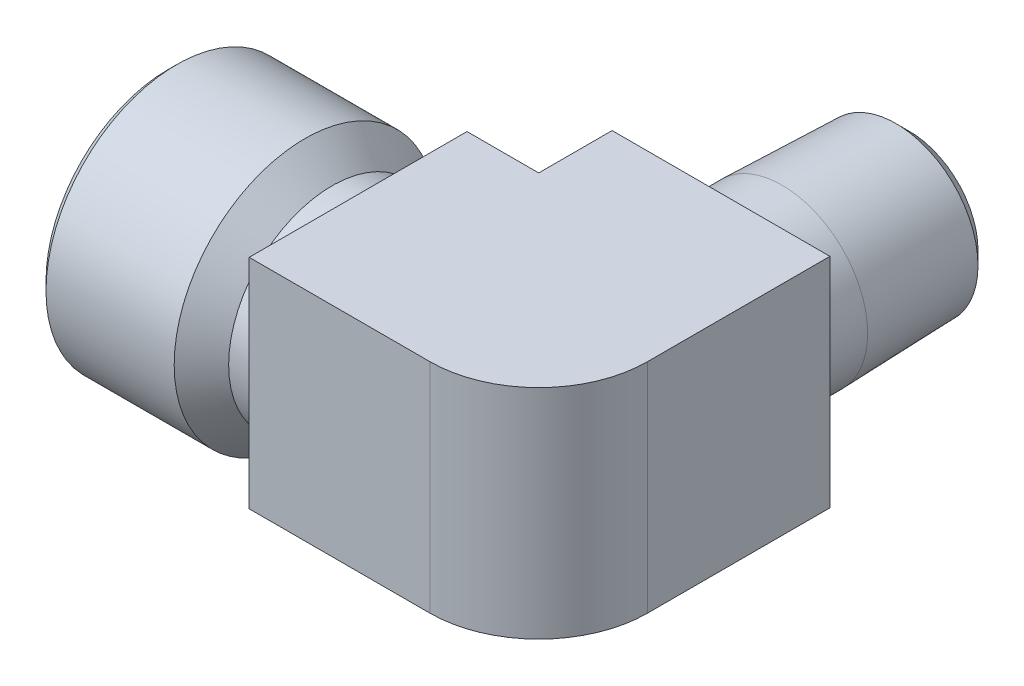
ISO-10303-21;
HEADER;
FILE_DESCRIPTION(('STEP AP214'),'2;1');
FILE_NAME('part.step','',(''),(''),'','','');
FILE_SCHEMA(('AUTOMOTIVE_DESIGN { 1 0 10303 214 1 1 1 1 }'));
ENDSEC;
DATA;
#1=APPLICATION_CONTEXT('core data for automotive mechanical design processes');
#2=APPLICATION_PROTOCOL_DEFINITION('international standard','automotive_design',2000,#1);
#3=PRODUCT_CONTEXT('',#1,'mechanical');
#4=PRODUCT('Part','Part','',(#3));
#5=PRODUCT_RELATED_PRODUCT_CATEGORY('part','',(#4));
#6=PRODUCT_DEFINITION_FORMATION('','',#4);
#7=PRODUCT_DEFINITION_CONTEXT('part definition',#1,'design');
#8=PRODUCT_DEFINITION('design','',#6,#7);
#9=PRODUCT_DEFINITION_SHAPE('','',#8);
#10=(LENGTH_UNIT() NAMED_UNIT(*) SI_UNIT(.MILLI.,.METRE.));
#11=(NAMED_UNIT(*) PLANE_ANGLE_UNIT() SI_UNIT($,.RADIAN.));
#12=(NAMED_UNIT(*) SI_UNIT($,.STERADIAN.) SOLID_ANGLE_UNIT());
#13=UNCERTAINTY_MEASURE_WITH_UNIT(LENGTH_MEASURE(1.E-05),#10,'distance_accuracy_value','');
#14=(GEOMETRIC_REPRESENTATION_CONTEXT(3) GLOBAL_UNCERTAINTY_ASSIGNED_CONTEXT((#13)) GLOBAL_UNIT_ASSIGNED_CONTEXT((#10,
#11,#12)) REPRESENTATION_CONTEXT('',''));
#15=CARTESIAN_POINT('',(0.,0.,0.));
#16=DIRECTION('',(0.,0.,1.));
#17=DIRECTION('',(1.,0.,0.));
#18=AXIS2_PLACEMENT_3D('',#15,#16,#17);
#19=CARTESIAN_POINT('',(1.12877599997319,0.,0.));
#20=DIRECTION('',(-1.,0.,0.));
#21=DIRECTION('',(0.,0.,1.));
#22=AXIS2_PLACEMENT_3D('',#19,#20,#21);
#23=CONICAL_SURFACE('',#22,5.67931299999991,0.0256563400042754);
#24=CARTESIAN_POINT('',(10.0203,0.,0.));
#25=DIRECTION('',(1.,0.,0.));
#26=DIRECTION('',(0.,0.,-1.));
#27=AXIS2_PLACEMENT_3D('',#24,#25,#26);
#28=CIRCLE('',#27,5.45113896988587);
#29=CARTESIAN_POINT('',(10.0203,0.,-5.45113896988587));
#30=VERTEX_POINT('',#29);
#31=EDGE_CURVE('E104',#30,#30,#28,.T.);
#32=ORIENTED_EDGE('',*,*,#31,.T.);
#33=EDGE_LOOP('',(#32));
#34=FACE_BOUND('',#33,.T.);
#35=CARTESIAN_POINT('',(1.12877600003003,0.,0.));
#36=DIRECTION('',(-1.,0.,0.));
#37=DIRECTION('',(0.,0.,-1.));
#38=AXIS2_PLACEMENT_3D('',#35,#36,#37);
#39=CIRCLE('',#38,5.67931299997326);
#40=CARTESIAN_POINT('',(1.12877600003003,0.,-5.67931299997326));
#41=VERTEX_POINT('',#40);
#42=EDGE_CURVE('E256',#41,#41,#39,.T.);
#43=ORIENTED_EDGE('',*,*,#42,.T.);
#44=EDGE_LOOP('',(#43));
#45=FACE_BOUND('',#44,.T.);
#46=ADVANCED_FACE('F16',(#34,#45),#23,.F.);
#47=CARTESIAN_POINT('',(-5.68438357222604E-11,0.,0.));
#48=DIRECTION('',(-1.,0.,0.));
#49=DIRECTION('',(0.,0.,1.));
#50=AXIS2_PLACEMENT_3D('',#47,#48,#49);
#51=CONICAL_SURFACE('',#50,6.80808900006014,0.785398163397448);
#52=ORIENTED_EDGE('',*,*,#42,.F.);
#53=EDGE_LOOP('',(#52));
#54=FACE_BOUND('',#53,.T.);
#55=CARTESIAN_POINT('',(5.68430019993557E-11,0.,0.));
#56=DIRECTION('',(-1.,0.,0.));
#57=DIRECTION('',(0.,0.,1.));
#58=AXIS2_PLACEMENT_3D('',#55,#56,#57);
#59=CIRCLE('',#58,6.80808899994645);
#60=CARTESIAN_POINT('',(5.68425851379033E-11,0.,6.80808899994645));
#61=VERTEX_POINT('',#60);
#62=EDGE_CURVE('E103',#61,#61,#59,.F.);
#63=ORIENTED_EDGE('',*,*,#62,.F.);
#64=EDGE_LOOP('',(#63));
#65=FACE_BOUND('',#64,.T.);
#66=ADVANCED_FACE('F148',(#54,#65),#51,.F.);
#67=CARTESIAN_POINT('',(13.9114305150571,0.,0.));
#68=DIRECTION('',(1.,0.,0.));
#69=DIRECTION('',(0.,0.,-1.));
#70=AXIS2_PLACEMENT_3D('',#67,#68,#69);
#71=CYLINDRICAL_SURFACE('',#70,5.45113896988587);
#72=CARTESIAN_POINT('',(27.8228610301141,0.,0.));
#73=DIRECTION('',(1.,0.,0.));
#74=DIRECTION('',(0.,1.,0.));
#75=AXIS2_PLACEMENT_3D('',#72,#73,#74);
#76=CIRCLE('',#75,5.45113896988587);
#77=CARTESIAN_POINT('',(27.8228610301141,3.00891746061934,-4.54547376894735));
#78=VERTEX_POINT('',#77);
#79=CARTESIAN_POINT('',(27.8228610301141,-3.00891746061934,-4.54547376894734));
#80=VERTEX_POINT('',#79);
#81=EDGE_CURVE('E97',#78,#80,#76,.T.);
#82=ORIENTED_EDGE('',*,*,#81,.T.);
#83=CARTESIAN_POINT('',(27.8228610301141,-3.00891746061933,-4.54547376894736));
#84=CARTESIAN_POINT('',(27.7349198119855,-2.95351373307247,-4.58215871475006));
#85=CARTESIAN_POINT('',(27.6496891621434,-2.89446070962744,-4.61978348688427));
#86=CARTESIAN_POINT('',(27.4849148246585,-2.76933098411947,-4.69585540376988));
#87=CARTESIAN_POINT('',(27.4053720609343,-2.70325314528766,-4.73430268081407));
#88=CARTESIAN_POINT('',(27.2516968172436,-2.56384869759814,-4.81123569674424));
#89=CARTESIAN_POINT('',(27.1776091343437,-2.49047168107598,-4.84971958211876));
#90=CARTESIAN_POINT('',(27.0358754590781,-2.33714437953146,-4.92544217869873));
#91=CARTESIAN_POINT('',(26.9682292374351,-2.25719432865868,-4.96268093419273));
#92=CARTESIAN_POINT('',(26.8396584331133,-2.09078171424466,-5.03505724292087));
#93=CARTESIAN_POINT('',(26.7787519989994,-2.00430257343263,-5.07018901152304));
#94=CARTESIAN_POINT('',(26.6644196982228,-1.82539100879123,-5.13731368710424));
#95=CARTESIAN_POINT('',(26.6109927497559,-1.73295944872636,-5.16930704780981));
#96=CARTESIAN_POINT('',(26.5123863869596,-1.54291631488662,-5.22916891893917));
#97=CARTESIAN_POINT('',(26.4671805025088,-1.44532272084188,-5.25705061120318));
#98=CARTESIAN_POINT('',(26.3854640927888,-1.24539755583957,-5.30797133188177));
#99=CARTESIAN_POINT('',(26.3489511017814,-1.14306733828496,-5.33101173330969));
#100=CARTESIAN_POINT('',(26.266364561403,-0.872600549017273,-5.38349331336362));
#101=CARTESIAN_POINT('',(26.2274145978365,-0.701348221875679,-5.40865701457062));
#102=CARTESIAN_POINT('',(26.1752328710422,-0.353401118303035,-5.44247970507157));
#103=CARTESIAN_POINT('',(26.1619972397318,-0.176707164492384,-5.45114117671236));
#104=CARTESIAN_POINT('',(26.1620028033068,0.179462416864416,-5.45113672865011));
#105=CARTESIAN_POINT('',(26.1756600478007,0.358938459589324,-5.44219853115471));
#106=CARTESIAN_POINT('',(26.2294556976039,0.712140724672644,-5.40733849513127));
#107=CARTESIAN_POINT('',(26.2696005254539,0.885865541778837,-5.38141253752986));
#108=CARTESIAN_POINT('',(26.3739389012261,1.22198259274928,-5.31515891418252));
#109=CARTESIAN_POINT('',(26.4380182150287,1.38442437855224,-5.27489970003781));
#110=CARTESIAN_POINT('',(26.5875910879881,1.69574366322573,-5.18321815973958));
#111=CARTESIAN_POINT('',(26.6731002355157,1.84461117999737,-5.13178771111436));
#112=CARTESIAN_POINT('',(26.8709288785881,2.13853238805546,-5.01682775784338));
#113=CARTESIAN_POINT('',(26.9848989918246,2.28221089775577,-4.95264429804545));
#114=CARTESIAN_POINT('',(27.232319997251,2.54944190531762,-4.82052282182768));
#115=CARTESIAN_POINT('',(27.3657522408123,2.67301343255857,-4.75258843784371));
#116=CARTESIAN_POINT('',(27.5582802035208,2.82575266271654,-4.6617819458398));
#117=CARTESIAN_POINT('',(27.6097355650883,2.86435127071612,-4.63814028039786));
#118=CARTESIAN_POINT('',(27.7147284972524,2.93873551672546,-4.59136935109783));
#119=CARTESIAN_POINT('',(27.7682627200606,2.97452541819214,-4.56823935045447));
#120=CARTESIAN_POINT('',(27.8228610301141,3.00891746061933,-4.54547376894736));
#121=B_SPLINE_CURVE_WITH_KNOTS('',3,(#83,#84,#85,#86,#87,#88,#89,#90,#91,#92,#93,#94,#95,#96,
#97,#98,#99,#100,#101,#102,#103,#104,#105,#106,#107,#108,#109,#110,#111,#112,#113,#114,#115,
#116,#117,#118,#119,#120),.UNSPECIFIED.,.F.,.F.,(4,2,2,2,2,2,2,2,2,2,2,2,2,2,2,2,2,2,4),(0.,
0.330549125994344,0.661151823726943,0.994221302050018,1.327278920658,1.66121261031979,
1.99509795108102,2.3278884439718,2.66058442811145,3.19010741070196,3.71955073354044,
4.25724923932693,4.79507817076035,5.33037229704145,5.86605693997033,6.44682100731037,
7.02703219800775,7.23255514780071,7.43775983564309),.UNSPECIFIED.);
#122=EDGE_CURVE('E95',#80,#78,#121,.T.);
#123=ORIENTED_EDGE('',*,*,#122,.T.);
#124=EDGE_LOOP('',(#82,#123));
#125=FACE_BOUND('',#124,.T.);
#126=ORIENTED_EDGE('',*,*,#31,.F.);
#127=EDGE_LOOP('',(#126));
#128=FACE_BOUND('',#127,.T.);
#129=ADVANCED_FACE('F98',(#125,#128),#71,.F.);
#130=CARTESIAN_POINT('',(27.8228610301141,0.,0.));
#131=DIRECTION('',(1.,0.,0.));
#132=DIRECTION('',(0.,1.,0.));
#133=AXIS2_PLACEMENT_3D('',#130,#131,#132);
#134=SPHERICAL_SURFACE('',#133,5.45113896988587);
#135=ORIENTED_EDGE('',*,*,#81,.F.);
#136=CARTESIAN_POINT('',(27.8228610301141,3.00891746061935,-4.54547376894735));
#137=CARTESIAN_POINT('',(27.8634152820483,3.03446072312548,-4.52856564561903));
#138=CARTESIAN_POINT('',(27.904407216055,3.05912673323248,-4.51138493574606));
#139=CARTESIAN_POINT('',(27.9877963853062,3.10704103307572,-4.47623358830602));
#140=CARTESIAN_POINT('',(28.0302054393705,3.13026294626452,-4.45825502419309));
#141=CARTESIAN_POINT('',(28.116402665264,3.17520691910712,-4.4214875309477));
#142=CARTESIAN_POINT('',(28.1602019984082,3.19690089034557,-4.40269044697431));
#143=CARTESIAN_POINT('',(28.2491490505397,3.23870449763516,-4.36426563763949));
#144=CARTESIAN_POINT('',(28.2943071467146,3.25878436371748,-4.34462955324843));
#145=CARTESIAN_POINT('',(28.3859356621001,3.29727194419186,-4.30450667478441));
#146=CARTESIAN_POINT('',(28.4324155425656,3.3156482221911,-4.28401134108553));
#147=CARTESIAN_POINT('',(28.5266459515633,3.35063814200538,-4.24215020273342));
#148=CARTESIAN_POINT('',(28.5744048956,3.36721870616647,-4.2207757018417));
#149=CARTESIAN_POINT('',(28.6711457242138,3.39852430592184,-4.17713684546604));
#150=CARTESIAN_POINT('',(28.720134848113,3.41321465149363,-4.15486366115773));
#151=CARTESIAN_POINT('',(28.819281914952,3.44064493259195,-4.10940849679077));
#152=CARTESIAN_POINT('',(28.8694457902659,3.45334860102268,-4.08621757937684));
#153=CARTESIAN_POINT('',(28.9708814361423,3.47670908077285,-4.03890850379508));
#154=CARTESIAN_POINT('',(29.0221577006785,3.48732808990097,-4.01478132370317));
#155=CARTESIAN_POINT('',(29.1257500195079,3.50642170983947,-3.96558181887924));
#156=CARTESIAN_POINT('',(29.1780689972524,3.51485703305327,-3.94050041142332));
#157=CARTESIAN_POINT('',(29.2836710840083,3.52948515426948,-3.88937512586166));
#158=CARTESIAN_POINT('',(29.3369554132805,3.53563723754148,-3.86332212769686));
#159=CARTESIAN_POINT('',(29.4444046324901,3.54560071557506,-3.81023694240232));
#160=CARTESIAN_POINT('',(29.4985689065948,3.54937003625026,-3.78319562092964));
#161=CARTESIAN_POINT('',(29.607686188899,3.55447037913219,-3.72811770255836));
#162=CARTESIAN_POINT('',(29.6626366125165,3.55575804606544,-3.70007197956478));
#163=CARTESIAN_POINT('',(29.7732257863963,3.55579865563879,-3.64296982357742));
#164=CARTESIAN_POINT('',(29.8288598515762,3.55450705121141,-3.6139042946511));
#165=CARTESIAN_POINT('',(29.9407070181308,3.5492945483829,-3.55474776167923));
#166=CARTESIAN_POINT('',(29.9969132038995,3.54532801248642,-3.52464771307454));
#167=CARTESIAN_POINT('',(30.1097861631074,3.53467364611817,-3.46340806226879));
#168=CARTESIAN_POINT('',(30.1664436631033,3.527939201694,-3.43225948732436));
#169=CARTESIAN_POINT('',(30.2800914002309,3.51166034126679,-3.36890941028857));
#170=CARTESIAN_POINT('',(30.337069882595,3.50206846193862,-3.33669902689106));
#171=CARTESIAN_POINT('',(30.4512221251393,3.47999016998805,-3.27121268850111));
#172=CARTESIAN_POINT('',(30.50838153083,3.46745558514251,-3.237927962462));
#173=CARTESIAN_POINT('',(30.6227483822308,3.43941227807928,-3.17028104663014));
#174=CARTESIAN_POINT('',(30.6799387616927,3.42385482895255,-3.13591021396514));
#175=CARTESIAN_POINT('',(30.7942104363221,3.38969198300181,-3.06608000606884));
#176=CARTESIAN_POINT('',(30.851271849494,3.37103747168905,-3.0306121337246));
#177=CARTESIAN_POINT('',(30.9651184656267,3.33061352542916,-2.95857754452099));
#178=CARTESIAN_POINT('',(31.0218808753143,3.30879477113224,-2.92200249173053));
#179=CARTESIAN_POINT('',(31.1349525246197,3.26198262540894,-2.84774441583464));
#180=CARTESIAN_POINT('',(31.1912359780833,3.23693989611648,-2.81005323888544));
#181=CARTESIAN_POINT('',(31.3031622886829,3.18363028366685,-2.73355377191759));
#182=CARTESIAN_POINT('',(31.3587762852237,3.15531427730635,-2.6947375081705));
#183=CARTESIAN_POINT('',(31.4691685342691,3.09541226614599,-2.61598370971724));
#184=CARTESIAN_POINT('',(31.5239148301894,3.06377746386228,-2.57603846616813));
#185=CARTESIAN_POINT('',(31.6202410477983,3.00466226459321,-2.50406342374387));
#186=CARTESIAN_POINT('',(31.6621919389632,2.97768554872489,-2.47211458151596));
#187=CARTESIAN_POINT('',(31.7450438546768,2.92192949464733,-2.40775337901469));
#188=CARTESIAN_POINT('',(31.7859368357892,2.89314009057253,-2.37533937648732));
#189=CARTESIAN_POINT('',(31.8665989786538,2.83377987973927,-2.31006194830496));
#190=CARTESIAN_POINT('',(31.9063595310734,2.80319907416766,-2.27719698025179));
#191=CARTESIAN_POINT('',(31.9846827496433,2.74028463221144,-2.21102619583303));
#192=CARTESIAN_POINT('',(32.0232362453755,2.70794113005324,-2.17771890583919));
#193=CARTESIAN_POINT('',(32.0990706766404,2.64153292337876,-2.11067250096609));
#194=CARTESIAN_POINT('',(32.1363418849316,2.60745852521502,-2.07693198666278));
#195=CARTESIAN_POINT('',(32.2095367830106,2.53762399602361,-2.00902754338441));
#196=CARTESIAN_POINT('',(32.2454501974422,2.50185438693087,-1.97486228730108));
#197=CARTESIAN_POINT('',(32.3158542524418,2.42867029996247,-1.90611457431149));
#198=CARTESIAN_POINT('',(32.3503340803849,2.39124661223811,-1.87153084977683));
#199=CARTESIAN_POINT('',(32.4177959625179,2.31479386804946,-1.80195795989633));
#200=CARTESIAN_POINT('',(32.4507666832759,2.27575587699678,-1.7669676237266));
#201=CARTESIAN_POINT('',(32.5141606417924,2.19734294545845,-1.69763431461479));
#202=CARTESIAN_POINT('',(32.5446257761427,2.15799800823414,-1.66329569466419));
#203=CARTESIAN_POINT('',(32.6039104850176,2.07804464682662,-1.59433061908926));
#204=CARTESIAN_POINT('',(32.6327245090319,2.03743259736475,-1.55970359503358));
#205=CARTESIAN_POINT('',(32.6886567450369,1.95499746029362,-1.49017930661313));
#206=CARTESIAN_POINT('',(32.7157691828292,1.91317088669288,-1.45528153072876));
#207=CARTESIAN_POINT('',(32.7682491269511,1.82836699682322,-1.38522643224935));
#208=CARTESIAN_POINT('',(32.793610647948,1.78538636966804,-1.35006863426716));
#209=CARTESIAN_POINT('',(32.8425410538476,1.6983358907738,-1.27950530564995));
#210=CARTESIAN_POINT('',(32.8661037563954,1.65426291657118,-1.24409934044272));
#211=CARTESIAN_POINT('',(32.9113902847869,1.56509219116676,-1.17305053774288));
#212=CARTESIAN_POINT('',(32.9331077459542,1.51999152353626,-1.13740730409308));
#213=CARTESIAN_POINT('',(32.974659127638,1.42883224670311,-1.06589452241999));
#214=CARTESIAN_POINT('',(32.9944865164293,1.38277094160944,-1.03002461611925));
#215=CARTESIAN_POINT('',(33.0322147622149,1.28975967107908,-0.958068668873447));
#216=CARTESIAN_POINT('',(33.0501089360031,1.24280724363517,-0.921982306507774));
#217=CARTESIAN_POINT('',(33.0839295342481,1.14808534588886,-0.849603375275531));
#218=CARTESIAN_POINT('',(33.0998491396779,1.10031365910678,-0.813310521049314));
#219=CARTESIAN_POINT('',(33.1296812573282,1.0040271256376,-0.740528361116257));
#220=CARTESIAN_POINT('',(33.1435868302404,0.955510318114494,-0.704038805419632));
#221=CARTESIAN_POINT('',(33.1693535113052,0.85780960391135,-0.630872921674525));
#222=CARTESIAN_POINT('',(33.1812075750843,0.808624000648123,-0.594196378517545));
#223=CARTESIAN_POINT('',(33.2028359427466,0.70966384310137,-0.520666221546165));
#224=CARTESIAN_POINT('',(33.2126031119205,0.659887863687612,-0.483812427253336));
#225=CARTESIAN_POINT('',(33.2300245532683,0.559827094305827,-0.409937593199552));
#226=CARTESIAN_POINT('',(33.2376716144005,0.509541156570013,-0.372916407611598));
#227=CARTESIAN_POINT('',(33.2508220237214,0.408542495844816,-0.298716853902561));
#228=CARTESIAN_POINT('',(33.2563180979465,0.357828907184674,-0.261538374968183));
#229=CARTESIAN_POINT('',(33.2651378921618,0.256058766860501,-0.187034615923172));
#230=CARTESIAN_POINT('',(33.268454286929,0.205001635425587,-0.149709260624513));
#231=CARTESIAN_POINT('',(33.2728892655122,0.102629838363063,-0.0749226711182586));
#232=CARTESIAN_POINT('',(33.2740004865382,0.0513148815860485,-0.0374613987022869));
#233=CARTESIAN_POINT('',(33.274,0.,0.));
#234=B_SPLINE_CURVE_WITH_KNOTS('',3,(#136,#137,#138,#139,#140,#141,#142,#143,#144,#145,#146,
#147,#148,#149,#150,#151,#152,#153,#154,#155,#156,#157,#158,#159,#160,#161,#162,#163,#164,#165,
#166,#167,#168,#169,#170,#171,#172,#173,#174,#175,#176,#177,#178,#179,#180,#181,#182,#183,#184,
#185,#186,#187,#188,#189,#190,#191,#192,#193,#194,#195,#196,#197,#198,#199,#200,#201,#202,#203,
#204,#205,#206,#207,#208,#209,#210,#211,#212,#213,#214,#215,#216,#217,#218,#219,#220,#221,#222,
#223,#224,#225,#226,#227,#228,#229,#230,#231,#232,#233),.UNSPECIFIED.,.F.,.F.,(4,2,2,2,2,2,2,2,
2,2,2,2,2,2,2,2,2,2,2,2,2,2,2,2,2,2,2,2,2,2,2,2,2,2,2,2,2,2,2,2,2,2,2,2,2,2,2,2,4),(0.,
0.152457877419052,0.307171524009202,0.464231587323529,0.623726137073317,0.785740953660582,
0.950359796563216,1.11766464812835,1.28773592893778,1.46065268151896,1.6364927197882,
1.81533274223378,1.99724840747757,2.18231437149765,2.37060428645202,2.5621907617136,
2.75714528840656,2.95553812941877,3.15743817754796,3.36291278511068,3.57202756899414,
3.78484619574879,4.0014301518921,4.22183850510849,4.44612766247208,4.62378586827036,
4.80253667988524,4.98240338060049,5.16340807041966,5.345571569979,5.52891333936689,
5.71345141276556,5.89920234966938,6.08054332578822,6.26246190811597,6.44496771159575,
6.62806931170748,6.81177425664935,6.99608909172127,7.1810193955314,7.36656982753304,
7.55274418628973,7.73954547776237,7.92697599281334,8.11503739302982,8.3037308038816,
8.49305691414854,8.6830160804791,8.87360843587521),.UNSPECIFIED.);
#235=CARTESIAN_POINT('',(33.274,0.,0.));
#236=VERTEX_POINT('',#235);
#237=EDGE_CURVE('E111',#78,#236,#234,.T.);
#238=ORIENTED_EDGE('',*,*,#237,.T.);
#239=CARTESIAN_POINT('',(33.274,0.,0.));
#240=CARTESIAN_POINT('',(33.2740004865993,-0.0513165455514477,-0.0374626136061651));
#241=CARTESIAN_POINT('',(33.2728891934733,-0.102633166430921,-0.0749251007074303));
#242=CARTESIAN_POINT('',(33.2684539366609,-0.205008062971294,-0.149713954492628));
#243=CARTESIAN_POINT('',(33.2651373455688,-0.256066630173907,-0.187040359443855));
#244=CARTESIAN_POINT('',(33.2563170544508,-0.357839408504924,-0.261546050345987));
#245=CARTESIAN_POINT('',(33.2508206893723,-0.408554200182751,-0.298725411599191));
#246=CARTESIAN_POINT('',(33.2376696239085,-0.509555030413749,-0.372926561218364));
#247=CARTESIAN_POINT('',(33.2300222071162,-0.559841935797349,-0.409948460562538));
#248=CARTESIAN_POINT('',(33.2126000096363,-0.659904402861554,-0.483824552975474));
#249=CARTESIAN_POINT('',(33.202832449514,-0.709681113844405,-0.52067889208378));
#250=CARTESIAN_POINT('',(33.1812032844867,-0.808642497677702,-0.594209969996217));
#251=CARTESIAN_POINT('',(33.1693488236974,-0.857828597561085,-0.630886889536225));
#252=CARTESIAN_POINT('',(33.1435813620888,-0.955530070727694,-0.704053358679471));
#253=CARTESIAN_POINT('',(33.1296754149217,-1.00404714285807,-0.740543123691482));
#254=CARTESIAN_POINT('',(33.0998425906773,-1.10033397560016,-0.81332553705865));
#255=CARTESIAN_POINT('',(33.083922662049,-1.14810569966573,-0.849618435745167));
#256=CARTESIAN_POINT('',(33.0501014871535,-1.24282744807949,-0.921997293706581));
#257=CARTESIAN_POINT('',(33.0322070689058,-1.28977969187137,-0.958083538723062));
#258=CARTESIAN_POINT('',(32.9944784310708,-1.38279037887479,-1.03003909291876));
#259=CARTESIAN_POINT('',(32.9746509035248,-1.4288512873957,-1.06590872394052));
#260=CARTESIAN_POINT('',(32.933099367521,-1.5200095641343,-1.13742080133399));
#261=CARTESIAN_POINT('',(32.9113818994571,-1.56510963187483,-1.17306360644532));
#262=CARTESIAN_POINT('',(32.8660955058968,-1.65427896122542,-1.24411140389679));
#263=CARTESIAN_POINT('',(32.8425329535702,-1.69835114321712,-1.27951679289708));
#264=CARTESIAN_POINT('',(32.7936030211753,-1.78539985385786,-1.3500788268906));
#265=CARTESIAN_POINT('',(32.7682418317718,-1.82837950923476,-1.38523590700188));
#266=CARTESIAN_POINT('',(32.7157627473638,-1.91318128417476,-1.45528943577745));
#267=CARTESIAN_POINT('',(32.6886508458104,-1.95500671919297,-1.49018636041678));
#268=CARTESIAN_POINT('',(32.6327199008436,-2.03743942630177,-1.5597088159298));
#269=CARTESIAN_POINT('',(32.6039066395487,-2.07805018923808,-1.59433485896552));
#270=CARTESIAN_POINT('',(32.5446236966364,-2.15800082635045,-1.66329786693119));
#271=CARTESIAN_POINT('',(32.5141595732407,-2.19734433096882,-1.69763540095591));
#272=CARTESIAN_POINT('',(32.4507631889063,-2.27576013387085,-1.76697152981886));
#273=CARTESIAN_POINT('',(32.4177887787161,-2.3148022482463,-1.80196574509762));
#274=CARTESIAN_POINT('',(32.3503201938723,-2.39126180029777,-1.87154519581766));
#275=CARTESIAN_POINT('',(32.3158374076798,-2.42868821561544,-1.90613160824477));
#276=CARTESIAN_POINT('',(32.245428288354,-2.50187640812819,-1.97488354321417));
#277=CARTESIAN_POINT('',(32.2095128207355,-2.53764744011251,-2.00905033987033));
#278=CARTESIAN_POINT('',(32.1363148345889,-2.607483579411,-2.07695674014298));
#279=CARTESIAN_POINT('',(32.0990426421364,-2.64155821157825,-2.11069767762147));
#280=CARTESIAN_POINT('',(32.0232074171395,-2.70796576785421,-2.17774384602378));
#281=CARTESIAN_POINT('',(31.9846541603671,-2.74030843413097,-2.21105048341258));
#282=CARTESIAN_POINT('',(31.9063327407338,-2.80322020839548,-2.27721892856079));
#283=CARTESIAN_POINT('',(31.8665737946105,-2.83379923232261,-2.3100822172771));
#284=CARTESIAN_POINT('',(31.7859163202052,-2.89315502001942,-2.37535530001746));
#285=CARTESIAN_POINT('',(31.7450264453603,-2.92194183429046,-2.40776664407999));
#286=CARTESIAN_POINT('',(31.662182326731,-2.97769195759841,-2.47212162827945));
#287=CARTESIAN_POINT('',(31.6202361682149,-3.00466538569087,-2.50406691860142));
#288=CARTESIAN_POINT('',(31.5239143447077,-3.06377760206907,-2.57603901979497));
#289=CARTESIAN_POINT('',(31.4691675513014,-3.0954124739334,-2.61598485417867));
#290=CARTESIAN_POINT('',(31.3587743136079,-3.15531458447537,-2.69473975339608));
#291=CARTESIAN_POINT('',(31.3031598275603,-3.18363062261863,-2.73355652815368));
#292=CARTESIAN_POINT('',(31.1912325556341,-3.23694023583048,-2.81005696530439));
#293=CARTESIAN_POINT('',(31.1349486317987,-3.26198293661348,-2.84774860204069));
#294=CARTESIAN_POINT('',(31.0218760655194,-3.30879497873869,-2.92200753551339));
#295=CARTESIAN_POINT('',(30.9651132105538,-3.33061366032214,-2.95858298691175));
#296=CARTESIAN_POINT('',(30.8512657342392,-3.37103742064104,-3.03061831236516));
#297=CARTESIAN_POINT('',(30.7942039073492,-3.38969182114043,-3.0660865231833));
#298=CARTESIAN_POINT('',(30.6799314412867,-3.42385441366112,-3.13591734608803));
#299=CARTESIAN_POINT('',(30.6227406851671,-3.43941172258077,-3.17028845616887));
#300=CARTESIAN_POINT('',(30.5083731215225,-3.46745472535397,-3.23793586532013));
#301=CARTESIAN_POINT('',(30.4512133811772,-3.47998914853616,-3.27122080817056));
#302=CARTESIAN_POINT('',(30.3370605148243,-3.50206710124329,-3.33670751956701));
#303=CARTESIAN_POINT('',(30.280081744115,-3.51165880542097,-3.36891806008694));
#304=CARTESIAN_POINT('',(30.1664334796428,-3.52793730733536,-3.43226839231397));
#305=CARTESIAN_POINT('',(30.109775741335,-3.53467157084087,-3.46341706626348));
#306=CARTESIAN_POINT('',(29.9969023581341,-3.5453255746187,-3.52465685815489));
#307=CARTESIAN_POINT('',(29.9406959872514,-3.54929193130418,-3.55475694977666));
#308=CARTESIAN_POINT('',(29.8288485058597,-3.55450408210834,-3.61391351452931));
#309=CARTESIAN_POINT('',(29.7732143114028,-3.55579551620315,-3.64297903314772));
#310=CARTESIAN_POINT('',(29.6626249366299,-3.55575457916823,-3.7000811174331));
#311=CARTESIAN_POINT('',(29.6076744417203,-3.55446675760914,-3.72812677994525));
#312=CARTESIAN_POINT('',(29.4985570763087,-3.54936612510337,-3.78320452988933));
#313=CARTESIAN_POINT('',(29.4443927905889,-3.54559667195735,-3.81024574430611));
#314=CARTESIAN_POINT('',(29.336943609025,-3.53563295462233,-3.86333067205724));
#315=CARTESIAN_POINT('',(29.2836593290875,-3.52948076707167,-3.88938352059539));
#316=CARTESIAN_POINT('',(29.178057402897,-3.51485246851304,-3.9405084678721));
#317=CARTESIAN_POINT('',(29.1257385363275,-3.50641707481193,-3.965589687496));
#318=CARTESIAN_POINT('',(29.0221465024228,-3.48732335022992,-4.01478878234775));
#319=CARTESIAN_POINT('',(28.9708704114479,-3.47670430954512,-4.03891574108632));
#320=CARTESIAN_POINT('',(28.8694351756417,-3.45334380765418,-4.08622434465661));
#321=CARTESIAN_POINT('',(28.8192715365127,-3.44064015125924,-4.10941501215561));
#322=CARTESIAN_POINT('',(28.7201250050964,-3.41320993935991,-4.15486965262807));
#323=CARTESIAN_POINT('',(28.6711361799718,-3.39851965358753,-4.17714256365287));
#324=CARTESIAN_POINT('',(28.5743960118314,-3.36721422221894,-4.22078085483125));
#325=CARTESIAN_POINT('',(28.5266374288887,-3.35063376929238,-4.24215506445527));
#326=CARTESIAN_POINT('',(28.4324078046768,-3.31564412389701,-4.28401560722885));
#327=CARTESIAN_POINT('',(28.3859283471549,-3.29726801173341,-4.30451063721092));
#328=CARTESIAN_POINT('',(28.2943007397549,-3.2587808175456,-4.34463290089646));
#329=CARTESIAN_POINT('',(28.2491431277296,-3.2387011745613,-4.36426867476644));
#330=CARTESIAN_POINT('',(28.1601971053838,-3.19689807024645,-4.40269286148753));
#331=CARTESIAN_POINT('',(28.1163983168394,-3.17520438151792,-4.42148963385474));
#332=CARTESIAN_POINT('',(28.0302022408262,-3.13026103217515,-4.45825650811414));
#333=CARTESIAN_POINT('',(27.9877937908654,-3.10703946258444,-4.47623476527986));
#334=CARTESIAN_POINT('',(27.9044058899365,-3.05912590954106,-4.51138550888205));
#335=CARTESIAN_POINT('',(27.8634146188293,-3.03446030520623,-4.52856592224338));
#336=CARTESIAN_POINT('',(27.8228610301141,-3.00891746061935,-4.54547376894735));
#337=B_SPLINE_CURVE_WITH_KNOTS('',3,(#239,#240,#241,#242,#243,#244,#245,#246,#247,#248,#249,
#250,#251,#252,#253,#254,#255,#256,#257,#258,#259,#260,#261,#262,#263,#264,#265,#266,#267,#268,
#269,#270,#271,#272,#273,#274,#275,#276,#277,#278,#279,#280,#281,#282,#283,#284,#285,#286,#287,
#288,#289,#290,#291,#292,#293,#294,#295,#296,#297,#298,#299,#300,#301,#302,#303,#304,#305,#306,
#307,#308,#309,#310,#311,#312,#313,#314,#315,#316,#317,#318,#319,#320,#321,#322,#323,#324,#325,
#326,#327,#328,#329,#330,#331,#332,#333,#334,#335,#336),.UNSPECIFIED.,.F.,.F.,(4,2,2,2,2,2,2,2,
2,2,2,2,2,2,2,2,2,2,2,2,2,2,2,2,2,2,2,2,2,2,2,2,2,2,2,2,2,2,2,2,2,2,2,2,2,2,2,2,4),(0.,
0.190598535255206,0.380563057469795,0.569893699648614,0.758590818450695,0.946655102677754,
1.13408767783625,1.32089020556821,1.50706497681238,1.69261499763098,1.87754406671745,
2.06185684368761,2.24555890734932,2.42865680324483,2.6111580798636,2.79307131303343,
2.97440611811085,3.16017730664736,3.34472985535097,3.52808031945393,3.71024672839999,
3.89124853717779,4.07110656111113,4.24984289486118,4.42748081655662,4.65177209732895,
4.87218240751486,5.08876815187844,5.30158839542857,5.51070462167167,5.71618049384878,
5.91808162528326,6.11647536452311,6.31143060044782,6.50301759193703,6.69130782608006,
6.87637390825493,7.05828948673376,7.23712921378859,7.41296874458725,7.58588477448887,
7.75595511467866,7.92325880542412,8.08787626559083,8.24988947642521,8.40938219699065,
8.56644020802991,8.72115158041751,8.87360696375694),.UNSPECIFIED.);
#338=EDGE_CURVE('E109',#236,#80,#337,.T.);
#339=ORIENTED_EDGE('',*,*,#338,.T.);
#340=EDGE_LOOP('',(#135,#238,#339));
#341=FACE_BOUND('',#340,.T.);
#342=ADVANCED_FACE('F114',(#341),#134,.F.);
#343=CARTESIAN_POINT('',(0.,0.,-5.23875));
#344=DIRECTION('',(-1.,0.,0.));
#345=DIRECTION('',(0.,0.,1.));
#346=AXIS2_PLACEMENT_3D('',#343,#344,#345);
#347=PLANE('',#346);
#348=ORIENTED_EDGE('',*,*,#62,.T.);
#349=EDGE_LOOP('',(#348));
#350=FACE_BOUND('',#349,.T.);
#351=CARTESIAN_POINT('',(0.,0.,0.));
#352=DIRECTION('',(1.,0.,0.));
#353=DIRECTION('',(0.,0.,-1.));
#354=AXIS2_PLACEMENT_3D('',#351,#352,#353);
#355=CIRCLE('',#354,9.779);
#356=CARTESIAN_POINT('',(0.,0.,-9.779));
#357=VERTEX_POINT('',#356);
#358=EDGE_CURVE('E236',#357,#357,#355,.T.);
#359=ORIENTED_EDGE('',*,*,#358,.F.);
#360=EDGE_LOOP('',(#359));
#361=FACE_BOUND('',#360,.T.);
#362=ADVANCED_FACE('F131',(#350,#361),#347,.T.);
#363=CARTESIAN_POINT('',(29.718,0.,-22.16658));
#364=DIRECTION('',(0.,0.,-1.));
#365=DIRECTION('',(-1.,0.,0.));
#366=AXIS2_PLACEMENT_3D('',#363,#364,#365);
#367=CYLINDRICAL_SURFACE('',#366,3.556);
#368=CARTESIAN_POINT('',(29.718,0.,-29.718));
#369=DIRECTION('',(0.,0.,-1.));
#370=DIRECTION('',(-1.,0.,0.));
#371=AXIS2_PLACEMENT_3D('',#368,#369,#370);
#372=CIRCLE('',#371,3.556);
#373=CARTESIAN_POINT('',(26.162,0.,-29.718));
#374=VERTEX_POINT('',#373);
#375=EDGE_CURVE('E234',#374,#374,#372,.F.);
#376=ORIENTED_EDGE('',*,*,#375,.F.);
#377=EDGE_LOOP('',(#376));
#378=FACE_BOUND('',#377,.T.);
#379=ORIENTED_EDGE('',*,*,#338,.F.);
#380=ORIENTED_EDGE('',*,*,#237,.F.);
#381=ORIENTED_EDGE('',*,*,#122,.F.);
#382=EDGE_LOOP('',(#379,#380,#381));
#383=FACE_BOUND('',#382,.T.);
#384=ADVANCED_FACE('F108',(#378,#383),#367,.F.);
#385=CARTESIAN_POINT('',(0.6985,0.,0.));
#386=DIRECTION('',(1.,0.,0.));
#387=DIRECTION('',(0.,0.,-1.));
#388=AXIS2_PLACEMENT_3D('',#385,#386,#387);
#389=CONICAL_SURFACE('',#388,10.4775,0.785398163397449);
#390=ORIENTED_EDGE('',*,*,#358,.T.);
#391=EDGE_LOOP('',(#390));
#392=FACE_BOUND('',#391,.T.);
#393=CARTESIAN_POINT('',(0.698499999999999,0.,0.));
#394=DIRECTION('',(-1.,0.,0.));
#395=DIRECTION('',(0.,0.,1.));
#396=AXIS2_PLACEMENT_3D('',#393,#394,#395);
#397=CIRCLE('',#396,10.4775);
#398=CARTESIAN_POINT('',(0.698499999999998,0.,10.4775));
#399=VERTEX_POINT('',#398);
#400=EDGE_CURVE('E235',#399,#399,#397,.F.);
#401=ORIENTED_EDGE('',*,*,#400,.F.);
#402=EDGE_LOOP('',(#401));
#403=FACE_BOUND('',#402,.T.);
#404=ADVANCED_FACE('F130',(#392,#403),#389,.T.);
#405=CARTESIAN_POINT('',(26.4478780216776,0.,-29.718));
#406=DIRECTION('',(0.,0.,-1.));
#407=DIRECTION('',(-1.,0.,0.));
#408=AXIS2_PLACEMENT_3D('',#405,#406,#407);
#409=PLANE('',#408);
#410=CARTESIAN_POINT('',(29.718,0.,-29.7180000000594));
#411=DIRECTION('',(0.,0.,1.));
#412=DIRECTION('',(1.,0.,0.));
#413=AXIS2_PLACEMENT_3D('',#410,#411,#412);
#414=CIRCLE('',#413,5.49782999996494);
#415=CARTESIAN_POINT('',(35.2158299999649,0.,-29.7180000000594));
#416=VERTEX_POINT('',#415);
#417=EDGE_CURVE('E231',#416,#416,#414,.T.);
#418=ORIENTED_EDGE('',*,*,#417,.F.);
#419=EDGE_LOOP('',(#418));
#420=FACE_BOUND('',#419,.T.);
#421=ORIENTED_EDGE('',*,*,#375,.T.);
#422=EDGE_LOOP('',(#421));
#423=FACE_BOUND('',#422,.T.);
#424=ADVANCED_FACE('F220',(#420,#423),#409,.T.);
#425=CARTESIAN_POINT('',(6.5786,0.,0.));
#426=DIRECTION('',(-1.,0.,0.));
#427=DIRECTION('',(0.,0.,1.));
#428=AXIS2_PLACEMENT_3D('',#425,#426,#427);
#429=CYLINDRICAL_SURFACE('',#428,10.4775);
#430=CARTESIAN_POINT('',(10.9743875,0.,0.));
#431=DIRECTION('',(-1.,0.,0.));
#432=DIRECTION('',(0.,0.,-1.));
#433=AXIS2_PLACEMENT_3D('',#430,#431,#432);
#434=CIRCLE('',#433,10.4775);
#435=CARTESIAN_POINT('',(10.9743875,0.,-10.4775));
#436=VERTEX_POINT('',#435);
#437=EDGE_CURVE('E243',#436,#436,#434,.F.);
#438=ORIENTED_EDGE('',*,*,#437,.F.);
#439=EDGE_LOOP('',(#438));
#440=FACE_BOUND('',#439,.T.);
#441=ORIENTED_EDGE('',*,*,#400,.T.);
#442=EDGE_LOOP('',(#441));
#443=FACE_BOUND('',#442,.T.);
#444=ADVANCED_FACE('F217',(#440,#443),#429,.T.);
#445=CARTESIAN_POINT('',(29.718,0.,-28.6420874045348));
#446=DIRECTION('',(0.,0.,1.));
#447=DIRECTION('',(1.,0.,0.));
#448=AXIS2_PLACEMENT_3D('',#445,#446,#447);
#449=CONICAL_SURFACE('',#448,6.57374259543273,0.785398163371032);
#450=CARTESIAN_POINT('',(29.718,0.,-28.6420874044211));
#451=DIRECTION('',(0.,0.,1.));
#452=DIRECTION('',(-1.,0.,0.));
#453=AXIS2_PLACEMENT_3D('',#450,#451,#452);
#454=CIRCLE('',#453,6.57374259558195);
#455=CARTESIAN_POINT('',(23.1442574044181,0.,-28.6420874044211));
#456=VERTEX_POINT('',#455);
#457=EDGE_CURVE('E349',#456,#456,#454,.T.);
#458=ORIENTED_EDGE('',*,*,#457,.F.);
#459=EDGE_LOOP('',(#458));
#460=FACE_BOUND('',#459,.T.);
#461=ORIENTED_EDGE('',*,*,#417,.T.);
#462=EDGE_LOOP('',(#461));
#463=FACE_BOUND('',#462,.T.);
#464=ADVANCED_FACE('F213',(#460,#463),#449,.T.);
#465=CARTESIAN_POINT('',(10.9743875,0.,0.));
#466=DIRECTION('',(-1.,0.,0.));
#467=DIRECTION('',(0.,0.,1.));
#468=AXIS2_PLACEMENT_3D('',#465,#466,#467);
#469=CONICAL_SURFACE('',#468,10.4775,0.785398163397448);
#470=CARTESIAN_POINT('',(13.1572,0.,0.));
#471=DIRECTION('',(-1.,0.,0.));
#472=DIRECTION('',(0.,0.,1.));
#473=AXIS2_PLACEMENT_3D('',#470,#471,#472);
#474=CIRCLE('',#473,8.2946875);
#475=CARTESIAN_POINT('',(13.1572,0.,8.2946875));
#476=VERTEX_POINT('',#475);
#477=EDGE_CURVE('E346',#476,#476,#474,.F.);
#478=ORIENTED_EDGE('',*,*,#477,.F.);
#479=EDGE_LOOP('',(#478));
#480=FACE_BOUND('',#479,.T.);
#481=ORIENTED_EDGE('',*,*,#437,.T.);
#482=EDGE_LOOP('',(#481));
#483=FACE_BOUND('',#482,.T.);
#484=ADVANCED_FACE('F209',(#480,#483),#469,.T.);
#485=CARTESIAN_POINT('',(29.718,0.,-19.5122800000149));
#486=DIRECTION('',(0.,0.,1.));
#487=DIRECTION('',(1.,0.,0.));
#488=AXIS2_PLACEMENT_3D('',#485,#486,#487);
#489=CONICAL_SURFACE('',#488,6.85799999999857,0.0311250383212317);
#490=CARTESIAN_POINT('',(29.718,0.,-19.51228));
#491=DIRECTION('',(0.,0.,1.));
#492=DIRECTION('',(1.,0.,0.));
#493=AXIS2_PLACEMENT_3D('',#490,#491,#492);
#494=CIRCLE('',#493,6.858);
#495=CARTESIAN_POINT('',(36.576,0.,-19.51228));
#496=VERTEX_POINT('',#495);
#497=EDGE_CURVE('E329',#496,#496,#494,.T.);
#498=ORIENTED_EDGE('',*,*,#497,.F.);
#499=EDGE_LOOP('',(#498));
#500=FACE_BOUND('',#499,.T.);
#501=ORIENTED_EDGE('',*,*,#457,.T.);
#502=EDGE_LOOP('',(#501));
#503=FACE_BOUND('',#502,.T.);
#504=ADVANCED_FACE('F205',(#500,#503),#489,.T.);
#505=CARTESIAN_POINT('',(14.1986,0.,0.));
#506=DIRECTION('',(-1.,0.,0.));
#507=DIRECTION('',(0.,0.,1.));
#508=AXIS2_PLACEMENT_3D('',#505,#506,#507);
#509=CYLINDRICAL_SURFACE('',#508,8.2946875);
#510=CARTESIAN_POINT('',(15.24,0.,0.));
#511=DIRECTION('',(-1.,0.,0.));
#512=DIRECTION('',(0.,0.,1.));
#513=AXIS2_PLACEMENT_3D('',#510,#511,#512);
#514=CIRCLE('',#513,8.2946875);
#515=CARTESIAN_POINT('',(15.24,0.,8.2946875));
#516=VERTEX_POINT('',#515);
#517=EDGE_CURVE('E244',#516,#516,#514,.F.);
#518=ORIENTED_EDGE('',*,*,#517,.F.);
#519=EDGE_LOOP('',(#518));
#520=FACE_BOUND('',#519,.T.);
#521=ORIENTED_EDGE('',*,*,#477,.T.);
#522=EDGE_LOOP('',(#521));
#523=FACE_BOUND('',#522,.T.);
#524=ADVANCED_FACE('F201',(#520,#523),#509,.T.);
#525=CARTESIAN_POINT('',(29.718,0.,-17.06372));
#526=DIRECTION('',(0.,0.,1.));
#527=DIRECTION('',(1.,0.,0.));
#528=AXIS2_PLACEMENT_3D('',#525,#526,#527);
#529=CYLINDRICAL_SURFACE('',#528,6.858);
#530=CARTESIAN_POINT('',(29.718,0.,-14.61516));
#531=DIRECTION('',(0.,0.,1.));
#532=DIRECTION('',(1.,0.,0.));
#533=AXIS2_PLACEMENT_3D('',#530,#531,#532);
#534=CIRCLE('',#533,6.858);
#535=CARTESIAN_POINT('',(36.576,0.,-14.61516));
#536=VERTEX_POINT('',#535);
#537=EDGE_CURVE('E248',#536,#536,#534,.T.);
#538=ORIENTED_EDGE('',*,*,#537,.F.);
#539=EDGE_LOOP('',(#538));
#540=FACE_BOUND('',#539,.T.);
#541=ORIENTED_EDGE('',*,*,#497,.T.);
#542=EDGE_LOOP('',(#541));
#543=FACE_BOUND('',#542,.T.);
#544=ADVANCED_FACE('F198',(#540,#543),#529,.T.);
#545=CARTESIAN_POINT('',(15.24,8.73125,8.73125));
#546=DIRECTION('',(0.,1.,0.));
#547=DIRECTION('',(-1.,0.,0.));
#548=AXIS2_PLACEMENT_3D('',#545,#546,#547);
#549=PLANE('',#548);
#550=DIRECTION('',(1.,0.,0.));
#551=VECTOR('',#550,1.);
#552=CARTESIAN_POINT('',(15.24,8.73125,8.73125));
#553=LINE('',#552,#551);
#554=CARTESIAN_POINT('',(29.718,8.73125,8.73125));
#555=VERTEX_POINT('',#554);
#556=CARTESIAN_POINT('',(15.24,8.73125,8.73125));
#557=VERTEX_POINT('',#556);
#558=EDGE_CURVE('E58',#555,#557,#553,.F.);
#559=ORIENTED_EDGE('',*,*,#558,.F.);
#560=CARTESIAN_POINT('',(29.718,8.73125,0.));
#561=DIRECTION('',(0.,-1.,0.));
#562=DIRECTION('',(0.,0.,-1.));
#563=AXIS2_PLACEMENT_3D('',#560,#561,#562);
#564=CIRCLE('',#563,8.73125);
#565=CARTESIAN_POINT('',(38.44925,8.73125,0.));
#566=VERTEX_POINT('',#565);
#567=EDGE_CURVE('E252',#566,#555,#564,.T.);
#568=ORIENTED_EDGE('',*,*,#567,.F.);
#569=DIRECTION('',(0.,0.,-1.));
#570=VECTOR('',#569,1.);
#571=CARTESIAN_POINT('',(38.44925,8.73125,0.));
#572=LINE('',#571,#570);
#573=CARTESIAN_POINT('',(38.44925,8.73125,-14.61516));
#574=VERTEX_POINT('',#573);
#575=EDGE_CURVE('E51',#574,#566,#572,.F.);
#576=ORIENTED_EDGE('',*,*,#575,.F.);
#577=DIRECTION('',(-1.,0.,0.));
#578=VECTOR('',#577,1.);
#579=CARTESIAN_POINT('',(34.083625,8.73125,-14.61516));
#580=LINE('',#579,#578);
#581=CARTESIAN_POINT('',(20.98675,8.73125,-14.61516));
#582=VERTEX_POINT('',#581);
#583=EDGE_CURVE('E66',#582,#574,#580,.F.);
#584=ORIENTED_EDGE('',*,*,#583,.F.);
#585=DIRECTION('',(0.,0.,1.));
#586=VECTOR('',#585,1.);
#587=CARTESIAN_POINT('',(20.98675,8.73125,0.));
#588=LINE('',#587,#586);
#589=CARTESIAN_POINT('',(20.98675,8.73125,-8.73125));
#590=VERTEX_POINT('',#589);
#591=EDGE_CURVE('E293',#590,#582,#588,.F.);
#592=ORIENTED_EDGE('',*,*,#591,.F.);
#593=DIRECTION('',(-1.,0.,0.));
#594=VECTOR('',#593,1.);
#595=CARTESIAN_POINT('',(15.24,8.73125,-8.73125));
#596=LINE('',#595,#594);
#597=CARTESIAN_POINT('',(15.24,8.73125,-8.73125));
#598=VERTEX_POINT('',#597);
#599=EDGE_CURVE('E304',#598,#590,#596,.F.);
#600=ORIENTED_EDGE('',*,*,#599,.F.);
#601=DIRECTION('',(0.,0.,1.));
#602=VECTOR('',#601,1.);
#603=CARTESIAN_POINT('',(15.24,8.73125,-4.365625));
#604=LINE('',#603,#602);
#605=EDGE_CURVE('E314',#557,#598,#604,.F.);
#606=ORIENTED_EDGE('',*,*,#605,.F.);
#607=EDGE_LOOP('',(#559,#568,#576,#584,#592,#600,#606));
#608=FACE_BOUND('',#607,.T.);
#609=ADVANCED_FACE('F194',(#608),#549,.T.);
#610=CARTESIAN_POINT('',(15.24,-8.73125,8.73125));
#611=DIRECTION('',(0.,0.,1.));
#612=DIRECTION('',(1.,0.,0.));
#613=AXIS2_PLACEMENT_3D('',#610,#611,#612);
#614=PLANE('',#613);
#615=DIRECTION('',(0.,-1.,0.));
#616=VECTOR('',#615,1.);
#617=CARTESIAN_POINT('',(29.718,0.,8.73125));
#618=LINE('',#617,#616);
#619=CARTESIAN_POINT('',(29.718,-8.73125,8.73125));
#620=VERTEX_POINT('',#619);
#621=EDGE_CURVE('E277',#555,#620,#618,.T.);
#622=ORIENTED_EDGE('',*,*,#621,.F.);
#623=ORIENTED_EDGE('',*,*,#558,.T.);
#624=DIRECTION('',(0.,1.,0.));
#625=VECTOR('',#624,1.);
#626=CARTESIAN_POINT('',(15.24,0.,8.73125));
#627=LINE('',#626,#625);
#628=CARTESIAN_POINT('',(15.24,-8.73125,8.73125));
#629=VERTEX_POINT('',#628);
#630=EDGE_CURVE('E247',#629,#557,#627,.T.);
#631=ORIENTED_EDGE('',*,*,#630,.F.);
#632=DIRECTION('',(1.,0.,0.));
#633=VECTOR('',#632,1.);
#634=CARTESIAN_POINT('',(15.24,-8.73125,8.73125));
#635=LINE('',#634,#633);
#636=EDGE_CURVE('E254',#620,#629,#635,.F.);
#637=ORIENTED_EDGE('',*,*,#636,.F.);
#638=EDGE_LOOP('',(#622,#623,#631,#637));
#639=FACE_BOUND('',#638,.T.);
#640=ADVANCED_FACE('F190',(#639),#614,.T.);
#641=CARTESIAN_POINT('',(15.24,0.,-4.365625));
#642=DIRECTION('',(-1.,0.,0.));
#643=DIRECTION('',(0.,0.,1.));
#644=AXIS2_PLACEMENT_3D('',#641,#642,#643);
#645=PLANE('',#644);
#646=ORIENTED_EDGE('',*,*,#605,.T.);
#647=DIRECTION('',(0.,1.,0.));
#648=VECTOR('',#647,1.);
#649=CARTESIAN_POINT('',(15.24,8.73125,-8.73125));
#650=LINE('',#649,#648);
#651=CARTESIAN_POINT('',(15.24,-8.73125,-8.73125));
#652=VERTEX_POINT('',#651);
#653=EDGE_CURVE('E311',#652,#598,#650,.T.);
#654=ORIENTED_EDGE('',*,*,#653,.F.);
#655=DIRECTION('',(0.,0.,1.));
#656=VECTOR('',#655,1.);
#657=CARTESIAN_POINT('',(15.24,-8.73125,-8.73125));
#658=LINE('',#657,#656);
#659=EDGE_CURVE('E275',#629,#652,#658,.F.);
#660=ORIENTED_EDGE('',*,*,#659,.F.);
#661=ORIENTED_EDGE('',*,*,#630,.T.);
#662=EDGE_LOOP('',(#646,#654,#660,#661));
#663=FACE_BOUND('',#662,.T.);
#664=ORIENTED_EDGE('',*,*,#517,.T.);
#665=EDGE_LOOP('',(#664));
#666=FACE_BOUND('',#665,.T.);
#667=ADVANCED_FACE('F186',(#663,#666),#645,.T.);
#668=CARTESIAN_POINT('',(15.24,8.73125,-8.73125));
#669=DIRECTION('',(0.,0.,-1.));
#670=DIRECTION('',(-1.,0.,0.));
#671=AXIS2_PLACEMENT_3D('',#668,#669,#670);
#672=PLANE('',#671);
#673=ORIENTED_EDGE('',*,*,#653,.T.);
#674=ORIENTED_EDGE('',*,*,#599,.T.);
#675=DIRECTION('',(0.,1.,0.));
#676=VECTOR('',#675,1.);
#677=CARTESIAN_POINT('',(20.98675,8.73125,-8.73125));
#678=LINE('',#677,#676);
#679=CARTESIAN_POINT('',(20.98675,-8.73125,-8.73125));
#680=VERTEX_POINT('',#679);
#681=EDGE_CURVE('E301',#680,#590,#678,.T.);
#682=ORIENTED_EDGE('',*,*,#681,.F.);
#683=DIRECTION('',(1.,0.,0.));
#684=VECTOR('',#683,1.);
#685=CARTESIAN_POINT('',(15.24,-8.73125,-8.73125));
#686=LINE('',#685,#684);
#687=EDGE_CURVE('E298',#652,#680,#686,.T.);
#688=ORIENTED_EDGE('',*,*,#687,.F.);
#689=EDGE_LOOP('',(#673,#674,#682,#688));
#690=FACE_BOUND('',#689,.T.);
#691=ADVANCED_FACE('F182',(#690),#672,.T.);
#692=CARTESIAN_POINT('',(20.98675,8.73125,0.));
#693=DIRECTION('',(-1.,0.,0.));
#694=DIRECTION('',(0.,0.,1.));
#695=AXIS2_PLACEMENT_3D('',#692,#693,#694);
#696=PLANE('',#695);
#697=DIRECTION('',(0.,1.,0.));
#698=VECTOR('',#697,1.);
#699=CARTESIAN_POINT('',(20.98675,0.,-14.61516));
#700=LINE('',#699,#698);
#701=CARTESIAN_POINT('',(20.98675,-8.73125,-14.61516));
#702=VERTEX_POINT('',#701);
#703=EDGE_CURVE('E291',#702,#582,#700,.T.);
#704=ORIENTED_EDGE('',*,*,#703,.F.);
#705=DIRECTION('',(0.,0.,1.));
#706=VECTOR('',#705,1.);
#707=CARTESIAN_POINT('',(20.98675,-8.73125,-8.73125));
#708=LINE('',#707,#706);
#709=EDGE_CURVE('E288',#680,#702,#708,.F.);
#710=ORIENTED_EDGE('',*,*,#709,.F.);
#711=ORIENTED_EDGE('',*,*,#681,.T.);
#712=ORIENTED_EDGE('',*,*,#591,.T.);
#713=EDGE_LOOP('',(#704,#710,#711,#712));
#714=FACE_BOUND('',#713,.T.);
#715=ADVANCED_FACE('F178',(#714),#696,.T.);
#716=CARTESIAN_POINT('',(34.083625,0.,-14.61516));
#717=DIRECTION('',(0.,0.,-1.));
#718=DIRECTION('',(-1.,0.,0.));
#719=AXIS2_PLACEMENT_3D('',#716,#717,#718);
#720=PLANE('',#719);
#721=ORIENTED_EDGE('',*,*,#537,.T.);
#722=EDGE_LOOP('',(#721));
#723=FACE_BOUND('',#722,.T.);
#724=ORIENTED_EDGE('',*,*,#583,.T.);
#725=DIRECTION('',(0.,1.,0.));
#726=VECTOR('',#725,1.);
#727=CARTESIAN_POINT('',(38.44925,-8.73125,-14.61516));
#728=LINE('',#727,#726);
#729=CARTESIAN_POINT('',(38.44925,-8.73125,-14.61516));
#730=VERTEX_POINT('',#729);
#731=EDGE_CURVE('E251',#730,#574,#728,.T.);
#732=ORIENTED_EDGE('',*,*,#731,.F.);
#733=DIRECTION('',(1.,0.,0.));
#734=VECTOR('',#733,1.);
#735=CARTESIAN_POINT('',(15.24,-8.73125,-14.61516));
#736=LINE('',#735,#734);
#737=EDGE_CURVE('E285',#702,#730,#736,.T.);
#738=ORIENTED_EDGE('',*,*,#737,.F.);
#739=ORIENTED_EDGE('',*,*,#703,.T.);
#740=EDGE_LOOP('',(#724,#732,#738,#739));
#741=FACE_BOUND('',#740,.T.);
#742=ADVANCED_FACE('F175',(#723,#741),#720,.T.);
#743=CARTESIAN_POINT('',(38.44925,-8.73125,0.));
#744=DIRECTION('',(1.,0.,0.));
#745=DIRECTION('',(0.,0.,-1.));
#746=AXIS2_PLACEMENT_3D('',#743,#744,#745);
#747=PLANE('',#746);
#748=DIRECTION('',(0.,-1.,0.));
#749=VECTOR('',#748,1.);
#750=CARTESIAN_POINT('',(38.44925,0.,0.));
#751=LINE('',#750,#749);
#752=CARTESIAN_POINT('',(38.44925,-8.73125,0.));
#753=VERTEX_POINT('',#752);
#754=EDGE_CURVE('E36',#753,#566,#751,.F.);
#755=ORIENTED_EDGE('',*,*,#754,.F.);
#756=DIRECTION('',(0.,0.,1.));
#757=VECTOR('',#756,1.);
#758=CARTESIAN_POINT('',(38.44925,-8.73125,-8.73125));
#759=LINE('',#758,#757);
#760=EDGE_CURVE('E27',#730,#753,#759,.T.);
#761=ORIENTED_EDGE('',*,*,#760,.F.);
#762=ORIENTED_EDGE('',*,*,#731,.T.);
#763=ORIENTED_EDGE('',*,*,#575,.T.);
#764=EDGE_LOOP('',(#755,#761,#762,#763));
#765=FACE_BOUND('',#764,.T.);
#766=ADVANCED_FACE('F168',(#765),#747,.T.);
#767=CARTESIAN_POINT('',(29.718,0.,0.));
#768=DIRECTION('',(0.,-1.,0.));
#769=DIRECTION('',(0.,0.,-1.));
#770=AXIS2_PLACEMENT_3D('',#767,#768,#769);
#771=CYLINDRICAL_SURFACE('',#770,8.73125);
#772=ORIENTED_EDGE('',*,*,#754,.T.);
#773=ORIENTED_EDGE('',*,*,#567,.T.);
#774=ORIENTED_EDGE('',*,*,#621,.T.);
#775=CARTESIAN_POINT('',(29.718,-8.73125,0.));
#776=DIRECTION('',(0.,-1.,0.));
#777=DIRECTION('',(0.,0.,-1.));
#778=AXIS2_PLACEMENT_3D('',#775,#776,#777);
#779=CIRCLE('',#778,8.73125);
#780=EDGE_CURVE('E11',#753,#620,#779,.T.);
#781=ORIENTED_EDGE('',*,*,#780,.F.);
#782=EDGE_LOOP('',(#772,#773,#774,#781));
#783=FACE_BOUND('',#782,.T.);
#784=ADVANCED_FACE('F162',(#783),#771,.T.);
#785=CARTESIAN_POINT('',(15.24,-8.73125,-8.73125));
#786=DIRECTION('',(0.,-1.,0.));
#787=DIRECTION('',(1.,0.,0.));
#788=AXIS2_PLACEMENT_3D('',#785,#786,#787);
#789=PLANE('',#788);
#790=ORIENTED_EDGE('',*,*,#760,.T.);
#791=ORIENTED_EDGE('',*,*,#780,.T.);
#792=ORIENTED_EDGE('',*,*,#636,.T.);
#793=ORIENTED_EDGE('',*,*,#659,.T.);
#794=ORIENTED_EDGE('',*,*,#687,.T.);
#795=ORIENTED_EDGE('',*,*,#709,.T.);
#796=ORIENTED_EDGE('',*,*,#737,.T.);
#797=EDGE_LOOP('',(#790,#791,#792,#793,#794,#795,#796));
#798=FACE_BOUND('',#797,.T.);
#799=ADVANCED_FACE('F160',(#798),#789,.T.);
#800=CLOSED_SHELL('',(#46,#66,#129,#342,#362,#384,#404,#424,#444,#464,#484,#504,#524,#544,#609,
#640,#667,#691,#715,#742,#766,#784,#799));
#801=MANIFOLD_SOLID_BREP('B1',#800);
#802=ADVANCED_BREP_SHAPE_REPRESENTATION('',(#18,#801),#14);
#803=SHAPE_DEFINITION_REPRESENTATION(#9,#802);
ENDSEC;
END-ISO-10303-21;
